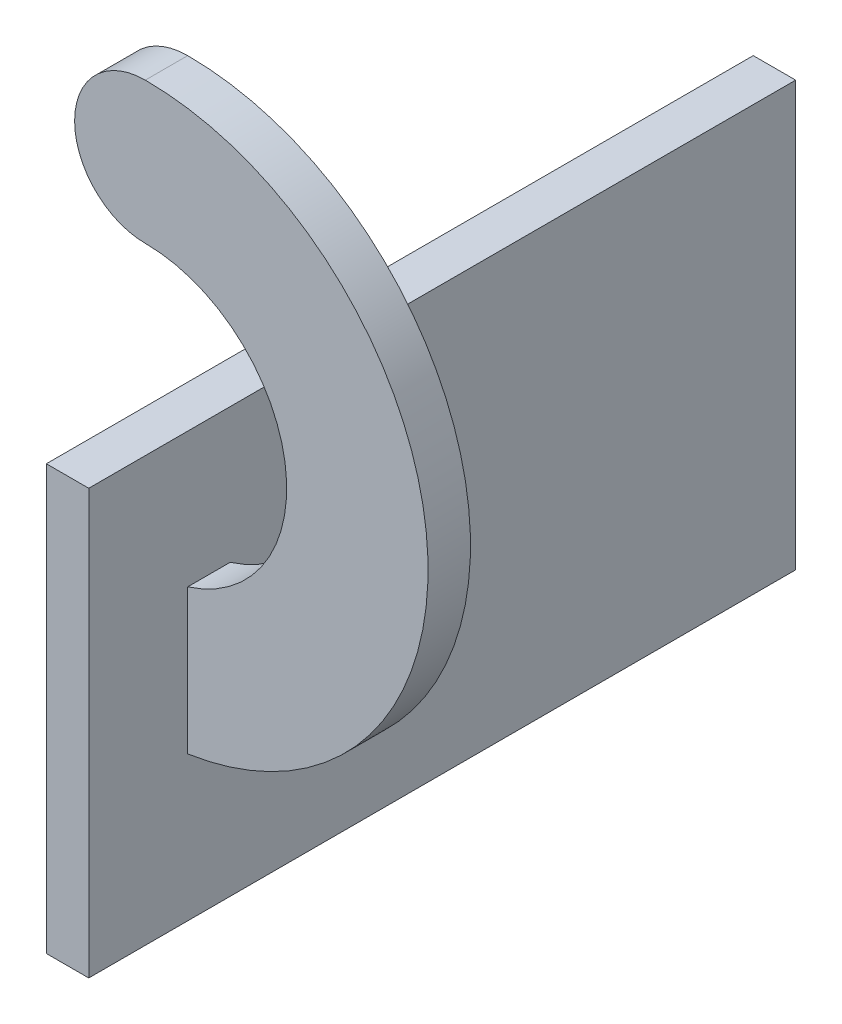
ISO-10303-21;
HEADER;
FILE_DESCRIPTION(('STEP AP214'),'2;1');
FILE_NAME('part.step','',(''),(''),'','','');
FILE_SCHEMA(('AUTOMOTIVE_DESIGN { 1 0 10303 214 1 1 1 1 }'));
ENDSEC;
DATA;
#1=APPLICATION_CONTEXT('core data for automotive mechanical design processes');
#2=APPLICATION_PROTOCOL_DEFINITION('international standard','automotive_design',2000,#1);
#3=PRODUCT_CONTEXT('',#1,'mechanical');
#4=PRODUCT('Part','Part','',(#3));
#5=PRODUCT_RELATED_PRODUCT_CATEGORY('part','',(#4));
#6=PRODUCT_DEFINITION_FORMATION('','',#4);
#7=PRODUCT_DEFINITION_CONTEXT('part definition',#1,'design');
#8=PRODUCT_DEFINITION('design','',#6,#7);
#9=PRODUCT_DEFINITION_SHAPE('','',#8);
#10=(LENGTH_UNIT() NAMED_UNIT(*) SI_UNIT(.MILLI.,.METRE.));
#11=(NAMED_UNIT(*) PLANE_ANGLE_UNIT() SI_UNIT($,.RADIAN.));
#12=(NAMED_UNIT(*) SI_UNIT($,.STERADIAN.) SOLID_ANGLE_UNIT());
#13=UNCERTAINTY_MEASURE_WITH_UNIT(LENGTH_MEASURE(1.E-05),#10,'distance_accuracy_value','');
#14=(GEOMETRIC_REPRESENTATION_CONTEXT(3) GLOBAL_UNCERTAINTY_ASSIGNED_CONTEXT((#13)) GLOBAL_UNIT_ASSIGNED_CONTEXT((#10,
#11,#12)) REPRESENTATION_CONTEXT('',''));
#15=CARTESIAN_POINT('',(0.,0.,0.));
#16=DIRECTION('',(0.,0.,1.));
#17=DIRECTION('',(1.,0.,0.));
#18=AXIS2_PLACEMENT_3D('',#15,#16,#17);
#19=CARTESIAN_POINT('',(0.,0.,0.));
#20=DIRECTION('',(0.,0.,1.));
#21=DIRECTION('',(1.,0.,0.));
#22=AXIS2_PLACEMENT_3D('',#19,#20,#21);
#23=PLANE('',#22);
#24=DIRECTION('',(0.,-1.,0.));
#25=VECTOR('',#24,1.);
#26=CARTESIAN_POINT('',(3.,0.,0.));
#27=LINE('',#26,#25);
#28=CARTESIAN_POINT('',(3.,-9.53939201416946,0.));
#29=VERTEX_POINT('',#28);
#30=CARTESIAN_POINT('',(3.,-19.7737199332852,0.));
#31=VERTEX_POINT('',#30);
#32=EDGE_CURVE('E51',#29,#31,#27,.T.);
#33=ORIENTED_EDGE('',*,*,#32,.F.);
#34=CARTESIAN_POINT('',(0.,0.,0.));
#35=DIRECTION('',(0.,0.,1.));
#36=DIRECTION('',(1.,0.,0.));
#37=AXIS2_PLACEMENT_3D('',#34,#35,#36);
#38=CIRCLE('',#37,10.);
#39=CARTESIAN_POINT('',(0.,10.,0.));
#40=VERTEX_POINT('',#39);
#41=EDGE_CURVE('E174',#29,#40,#38,.T.);
#42=ORIENTED_EDGE('',*,*,#41,.T.);
#43=CARTESIAN_POINT('',(0.,15.,0.));
#44=DIRECTION('',(0.,0.,1.));
#45=DIRECTION('',(1.,0.,0.));
#46=AXIS2_PLACEMENT_3D('',#43,#44,#45);
#47=CIRCLE('',#46,5.);
#48=CARTESIAN_POINT('',(0.,20.,0.));
#49=VERTEX_POINT('',#48);
#50=EDGE_CURVE('E184',#49,#40,#47,.T.);
#51=ORIENTED_EDGE('',*,*,#50,.F.);
#52=CARTESIAN_POINT('',(0.,0.,0.));
#53=DIRECTION('',(0.,0.,1.));
#54=DIRECTION('',(1.,0.,0.));
#55=AXIS2_PLACEMENT_3D('',#52,#53,#54);
#56=CIRCLE('',#55,20.);
#57=EDGE_CURVE('E169',#31,#49,#56,.T.);
#58=ORIENTED_EDGE('',*,*,#57,.F.);
#59=EDGE_LOOP('',(#33,#42,#51,#58));
#60=FACE_BOUND('',#59,.T.);
#61=ADVANCED_FACE('F41',(#60),#23,.F.);
#62=CARTESIAN_POINT('',(0.,0.,3.));
#63=DIRECTION('',(0.,0.,-1.));
#64=DIRECTION('',(-1.,0.,0.));
#65=AXIS2_PLACEMENT_3D('',#62,#63,#64);
#66=CYLINDRICAL_SURFACE('',#65,20.);
#67=DIRECTION('',(0.,0.,-1.));
#68=VECTOR('',#67,1.);
#69=CARTESIAN_POINT('',(3.,-19.7737199332852,3.));
#70=LINE('',#69,#68);
#71=CARTESIAN_POINT('',(3.,-19.7737199332852,3.));
#72=VERTEX_POINT('',#71);
#73=EDGE_CURVE('E66',#31,#72,#70,.F.);
#74=ORIENTED_EDGE('',*,*,#73,.F.);
#75=ORIENTED_EDGE('',*,*,#57,.T.);
#76=DIRECTION('',(0.,0.,-1.));
#77=VECTOR('',#76,1.);
#78=CARTESIAN_POINT('',(0.,20.,3.));
#79=LINE('',#78,#77);
#80=CARTESIAN_POINT('',(0.,20.,3.));
#81=VERTEX_POINT('',#80);
#82=EDGE_CURVE('E45',#81,#49,#79,.T.);
#83=ORIENTED_EDGE('',*,*,#82,.F.);
#84=CARTESIAN_POINT('',(0.,0.,3.));
#85=DIRECTION('',(0.,0.,1.));
#86=DIRECTION('',(1.,0.,0.));
#87=AXIS2_PLACEMENT_3D('',#84,#85,#86);
#88=CIRCLE('',#87,20.);
#89=EDGE_CURVE('E170',#72,#81,#88,.T.);
#90=ORIENTED_EDGE('',*,*,#89,.F.);
#91=EDGE_LOOP('',(#74,#75,#83,#90));
#92=FACE_BOUND('',#91,.T.);
#93=ADVANCED_FACE('F43',(#92),#66,.T.);
#94=CARTESIAN_POINT('',(0.,15.,3.));
#95=DIRECTION('',(0.,0.,-1.));
#96=DIRECTION('',(-1.,0.,0.));
#97=AXIS2_PLACEMENT_3D('',#94,#95,#96);
#98=CYLINDRICAL_SURFACE('',#97,5.);
#99=ORIENTED_EDGE('',*,*,#50,.T.);
#100=DIRECTION('',(0.,0.,-1.));
#101=VECTOR('',#100,1.);
#102=CARTESIAN_POINT('',(0.,10.,3.));
#103=LINE('',#102,#101);
#104=CARTESIAN_POINT('',(0.,10.,3.));
#105=VERTEX_POINT('',#104);
#106=EDGE_CURVE('E181',#105,#40,#103,.T.);
#107=ORIENTED_EDGE('',*,*,#106,.F.);
#108=CARTESIAN_POINT('',(0.,15.,3.));
#109=DIRECTION('',(0.,0.,1.));
#110=DIRECTION('',(1.,0.,0.));
#111=AXIS2_PLACEMENT_3D('',#108,#109,#110);
#112=CIRCLE('',#111,5.);
#113=EDGE_CURVE('E173',#81,#105,#112,.T.);
#114=ORIENTED_EDGE('',*,*,#113,.F.);
#115=ORIENTED_EDGE('',*,*,#82,.T.);
#116=EDGE_LOOP('',(#99,#107,#114,#115));
#117=FACE_BOUND('',#116,.T.);
#118=ADVANCED_FACE('F199',(#117),#98,.T.);
#119=CARTESIAN_POINT('',(0.,0.,3.));
#120=DIRECTION('',(0.,0.,-1.));
#121=DIRECTION('',(-1.,0.,0.));
#122=AXIS2_PLACEMENT_3D('',#119,#120,#121);
#123=CYLINDRICAL_SURFACE('',#122,10.);
#124=DIRECTION('',(0.,0.,-1.));
#125=VECTOR('',#124,1.);
#126=CARTESIAN_POINT('',(3.,-9.53939201416946,3.));
#127=LINE('',#126,#125);
#128=CARTESIAN_POINT('',(3.,-9.53939201416946,3.));
#129=VERTEX_POINT('',#128);
#130=EDGE_CURVE('E164',#129,#29,#127,.T.);
#131=ORIENTED_EDGE('',*,*,#130,.F.);
#132=CARTESIAN_POINT('',(0.,0.,3.));
#133=DIRECTION('',(0.,0.,1.));
#134=DIRECTION('',(1.,0.,0.));
#135=AXIS2_PLACEMENT_3D('',#132,#133,#134);
#136=CIRCLE('',#135,10.);
#137=EDGE_CURVE('E178',#129,#105,#136,.T.);
#138=ORIENTED_EDGE('',*,*,#137,.T.);
#139=ORIENTED_EDGE('',*,*,#106,.T.);
#140=ORIENTED_EDGE('',*,*,#41,.F.);
#141=EDGE_LOOP('',(#131,#138,#139,#140));
#142=FACE_BOUND('',#141,.T.);
#143=ADVANCED_FACE('F202',(#142),#123,.F.);
#144=CARTESIAN_POINT('',(0.,0.,3.));
#145=DIRECTION('',(1.,0.,0.));
#146=DIRECTION('',(0.,0.,-1.));
#147=AXIS2_PLACEMENT_3D('',#144,#145,#146);
#148=PLANE('',#147);
#149=DIRECTION('',(0.,0.,-1.));
#150=VECTOR('',#149,1.);
#151=CARTESIAN_POINT('',(0.,0.,3.));
#152=LINE('',#151,#150);
#153=CARTESIAN_POINT('',(0.,0.,10.));
#154=VERTEX_POINT('',#153);
#155=CARTESIAN_POINT('',(0.,0.,-40.));
#156=VERTEX_POINT('',#155);
#157=EDGE_CURVE('E158',#154,#156,#152,.T.);
#158=ORIENTED_EDGE('',*,*,#157,.T.);
#159=DIRECTION('',(0.,1.,0.));
#160=VECTOR('',#159,1.);
#161=CARTESIAN_POINT('',(0.,0.,-40.));
#162=LINE('',#161,#160);
#163=CARTESIAN_POINT('',(0.,-30.,-40.));
#164=VERTEX_POINT('',#163);
#165=EDGE_CURVE('E114',#164,#156,#162,.T.);
#166=ORIENTED_EDGE('',*,*,#165,.F.);
#167=DIRECTION('',(0.,0.,-1.));
#168=VECTOR('',#167,1.);
#169=CARTESIAN_POINT('',(0.,-30.,3.));
#170=LINE('',#169,#168);
#171=CARTESIAN_POINT('',(0.,-30.,10.));
#172=VERTEX_POINT('',#171);
#173=EDGE_CURVE('E108',#172,#164,#170,.T.);
#174=ORIENTED_EDGE('',*,*,#173,.F.);
#175=DIRECTION('',(0.,-1.,0.));
#176=VECTOR('',#175,1.);
#177=CARTESIAN_POINT('',(0.,0.,10.));
#178=LINE('',#177,#176);
#179=EDGE_CURVE('E112',#154,#172,#178,.T.);
#180=ORIENTED_EDGE('',*,*,#179,.F.);
#181=EDGE_LOOP('',(#158,#166,#174,#180));
#182=FACE_BOUND('',#181,.T.);
#183=ADVANCED_FACE('F110',(#182),#148,.F.);
#184=CARTESIAN_POINT('',(0.,0.,3.));
#185=DIRECTION('',(0.,0.,1.));
#186=DIRECTION('',(1.,0.,0.));
#187=AXIS2_PLACEMENT_3D('',#184,#185,#186);
#188=PLANE('',#187);
#189=DIRECTION('',(0.,1.,0.));
#190=VECTOR('',#189,1.);
#191=CARTESIAN_POINT('',(3.,0.,3.));
#192=LINE('',#191,#190);
#193=EDGE_CURVE('E11',#72,#129,#192,.T.);
#194=ORIENTED_EDGE('',*,*,#193,.F.);
#195=ORIENTED_EDGE('',*,*,#89,.T.);
#196=ORIENTED_EDGE('',*,*,#113,.T.);
#197=ORIENTED_EDGE('',*,*,#137,.F.);
#198=EDGE_LOOP('',(#194,#195,#196,#197));
#199=FACE_BOUND('',#198,.T.);
#200=ADVANCED_FACE('F206',(#199),#188,.T.);
#201=CARTESIAN_POINT('',(3.,0.,0.));
#202=DIRECTION('',(-1.,0.,0.));
#203=DIRECTION('',(0.,0.,1.));
#204=AXIS2_PLACEMENT_3D('',#201,#202,#203);
#205=PLANE('',#204);
#206=ORIENTED_EDGE('',*,*,#73,.T.);
#207=ORIENTED_EDGE('',*,*,#193,.T.);
#208=ORIENTED_EDGE('',*,*,#130,.T.);
#209=ORIENTED_EDGE('',*,*,#32,.T.);
#210=EDGE_LOOP('',(#206,#207,#208,#209));
#211=FACE_BOUND('',#210,.T.);
#212=DIRECTION('',(0.,0.,1.));
#213=VECTOR('',#212,1.);
#214=CARTESIAN_POINT('',(3.,-30.,3.));
#215=LINE('',#214,#213);
#216=CARTESIAN_POINT('',(3.,-30.,-40.));
#217=VERTEX_POINT('',#216);
#218=CARTESIAN_POINT('',(3.,-30.,10.));
#219=VERTEX_POINT('',#218);
#220=EDGE_CURVE('E119',#217,#219,#215,.T.);
#221=ORIENTED_EDGE('',*,*,#220,.F.);
#222=DIRECTION('',(0.,-1.,0.));
#223=VECTOR('',#222,1.);
#224=CARTESIAN_POINT('',(3.,0.,-40.));
#225=LINE('',#224,#223);
#226=CARTESIAN_POINT('',(3.,0.,-40.));
#227=VERTEX_POINT('',#226);
#228=EDGE_CURVE('E148',#227,#217,#225,.T.);
#229=ORIENTED_EDGE('',*,*,#228,.F.);
#230=DIRECTION('',(0.,0.,1.));
#231=VECTOR('',#230,1.);
#232=CARTESIAN_POINT('',(3.,0.,3.));
#233=LINE('',#232,#231);
#234=CARTESIAN_POINT('',(3.,0.,10.));
#235=VERTEX_POINT('',#234);
#236=EDGE_CURVE('E161',#227,#235,#233,.T.);
#237=ORIENTED_EDGE('',*,*,#236,.T.);
#238=DIRECTION('',(0.,1.,0.));
#239=VECTOR('',#238,1.);
#240=CARTESIAN_POINT('',(3.,0.,10.));
#241=LINE('',#240,#239);
#242=EDGE_CURVE('E129',#219,#235,#241,.T.);
#243=ORIENTED_EDGE('',*,*,#242,.F.);
#244=EDGE_LOOP('',(#221,#229,#237,#243));
#245=FACE_BOUND('',#244,.T.);
#246=ADVANCED_FACE('F207',(#211,#245),#205,.F.);
#247=CARTESIAN_POINT('',(0.,0.,0.));
#248=DIRECTION('',(0.,-1.,0.));
#249=DIRECTION('',(0.,0.,-1.));
#250=AXIS2_PLACEMENT_3D('',#247,#248,#249);
#251=PLANE('',#250);
#252=ORIENTED_EDGE('',*,*,#157,.F.);
#253=DIRECTION('',(-1.,0.,0.));
#254=VECTOR('',#253,1.);
#255=CARTESIAN_POINT('',(0.,0.,10.));
#256=LINE('',#255,#254);
#257=EDGE_CURVE('E134',#235,#154,#256,.T.);
#258=ORIENTED_EDGE('',*,*,#257,.F.);
#259=ORIENTED_EDGE('',*,*,#236,.F.);
#260=DIRECTION('',(1.,0.,0.));
#261=VECTOR('',#260,1.);
#262=CARTESIAN_POINT('',(0.,0.,-40.));
#263=LINE('',#262,#261);
#264=EDGE_CURVE('E144',#156,#227,#263,.T.);
#265=ORIENTED_EDGE('',*,*,#264,.F.);
#266=EDGE_LOOP('',(#252,#258,#259,#265));
#267=FACE_BOUND('',#266,.T.);
#268=ADVANCED_FACE('F210',(#267),#251,.F.);
#269=CARTESIAN_POINT('',(0.,-30.,0.));
#270=DIRECTION('',(0.,-1.,0.));
#271=DIRECTION('',(0.,0.,-1.));
#272=AXIS2_PLACEMENT_3D('',#269,#270,#271);
#273=PLANE('',#272);
#274=ORIENTED_EDGE('',*,*,#173,.T.);
#275=DIRECTION('',(-1.,0.,0.));
#276=VECTOR('',#275,1.);
#277=CARTESIAN_POINT('',(0.,-30.,-40.));
#278=LINE('',#277,#276);
#279=EDGE_CURVE('E120',#217,#164,#278,.T.);
#280=ORIENTED_EDGE('',*,*,#279,.F.);
#281=ORIENTED_EDGE('',*,*,#220,.T.);
#282=DIRECTION('',(1.,0.,0.));
#283=VECTOR('',#282,1.);
#284=CARTESIAN_POINT('',(0.,-30.,10.));
#285=LINE('',#284,#283);
#286=EDGE_CURVE('E123',#172,#219,#285,.T.);
#287=ORIENTED_EDGE('',*,*,#286,.F.);
#288=EDGE_LOOP('',(#274,#280,#281,#287));
#289=FACE_BOUND('',#288,.T.);
#290=ADVANCED_FACE('F124',(#289),#273,.T.);
#291=CARTESIAN_POINT('',(0.,0.,-40.));
#292=DIRECTION('',(0.,0.,1.));
#293=DIRECTION('',(1.,0.,0.));
#294=AXIS2_PLACEMENT_3D('',#291,#292,#293);
#295=PLANE('',#294);
#296=ORIENTED_EDGE('',*,*,#165,.T.);
#297=ORIENTED_EDGE('',*,*,#264,.T.);
#298=ORIENTED_EDGE('',*,*,#228,.T.);
#299=ORIENTED_EDGE('',*,*,#279,.T.);
#300=EDGE_LOOP('',(#296,#297,#298,#299));
#301=FACE_BOUND('',#300,.T.);
#302=ADVANCED_FACE('F214',(#301),#295,.F.);
#303=CARTESIAN_POINT('',(0.,0.,10.));
#304=DIRECTION('',(0.,0.,1.));
#305=DIRECTION('',(1.,0.,0.));
#306=AXIS2_PLACEMENT_3D('',#303,#304,#305);
#307=PLANE('',#306);
#308=ORIENTED_EDGE('',*,*,#179,.T.);
#309=ORIENTED_EDGE('',*,*,#286,.T.);
#310=ORIENTED_EDGE('',*,*,#242,.T.);
#311=ORIENTED_EDGE('',*,*,#257,.T.);
#312=EDGE_LOOP('',(#308,#309,#310,#311));
#313=FACE_BOUND('',#312,.T.);
#314=ADVANCED_FACE('F132',(#313),#307,.T.);
#315=CLOSED_SHELL('',(#61,#93,#118,#143,#183,#200,#246,#268,#290,#302,#314));
#316=MANIFOLD_SOLID_BREP('B2',#315);
#317=ADVANCED_BREP_SHAPE_REPRESENTATION('',(#18,#316),#14);
#318=SHAPE_DEFINITION_REPRESENTATION(#9,#317);
ENDSEC;
END-ISO-10303-21;
